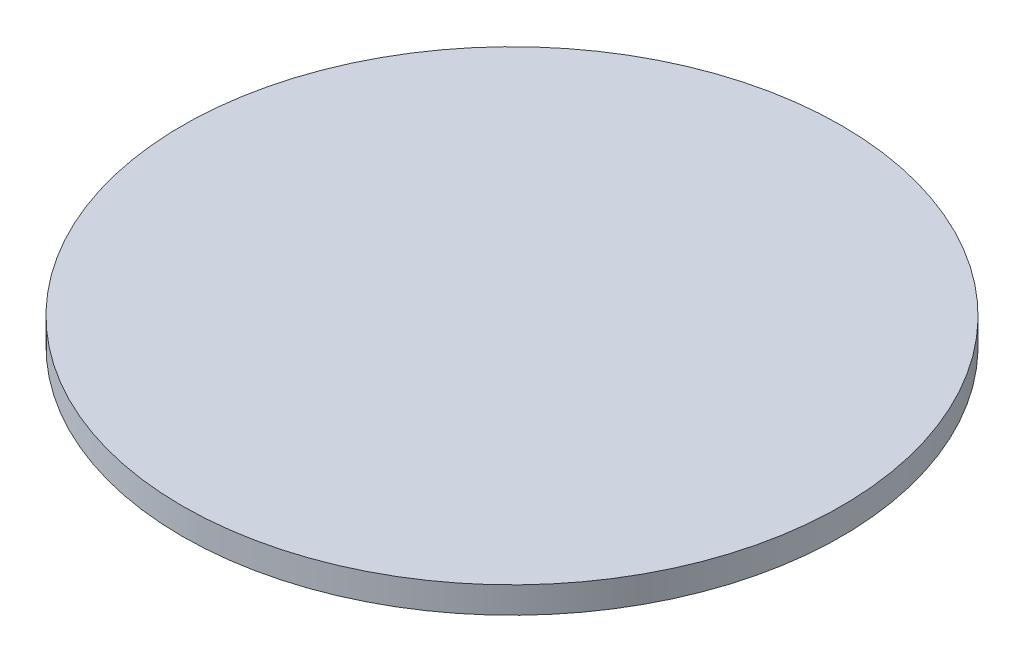
ISO-10303-21;
HEADER;
FILE_DESCRIPTION(('STEP AP214'),'2;1');
FILE_NAME('part.step','',(''),(''),'','','');
FILE_SCHEMA(('AUTOMOTIVE_DESIGN { 1 0 10303 214 1 1 1 1 }'));
ENDSEC;
DATA;
#1=APPLICATION_CONTEXT('core data for automotive mechanical design processes');
#2=APPLICATION_PROTOCOL_DEFINITION('international standard','automotive_design',2000,#1);
#3=PRODUCT_CONTEXT('',#1,'mechanical');
#4=PRODUCT('Part','Part','',(#3));
#5=PRODUCT_RELATED_PRODUCT_CATEGORY('part','',(#4));
#6=PRODUCT_DEFINITION_FORMATION('','',#4);
#7=PRODUCT_DEFINITION_CONTEXT('part definition',#1,'design');
#8=PRODUCT_DEFINITION('design','',#6,#7);
#9=PRODUCT_DEFINITION_SHAPE('','',#8);
#10=(LENGTH_UNIT() NAMED_UNIT(*) SI_UNIT(.MILLI.,.METRE.));
#11=(NAMED_UNIT(*) PLANE_ANGLE_UNIT() SI_UNIT($,.RADIAN.));
#12=(NAMED_UNIT(*) SI_UNIT($,.STERADIAN.) SOLID_ANGLE_UNIT());
#13=UNCERTAINTY_MEASURE_WITH_UNIT(LENGTH_MEASURE(1.E-05),#10,'distance_accuracy_value','');
#14=(GEOMETRIC_REPRESENTATION_CONTEXT(3) GLOBAL_UNCERTAINTY_ASSIGNED_CONTEXT((#13)) GLOBAL_UNIT_ASSIGNED_CONTEXT((#10,
#11,#12)) REPRESENTATION_CONTEXT('',''));
#15=CARTESIAN_POINT('',(0.,0.,0.));
#16=DIRECTION('',(0.,0.,1.));
#17=DIRECTION('',(1.,0.,0.));
#18=AXIS2_PLACEMENT_3D('',#15,#16,#17);
#19=CARTESIAN_POINT('',(-1.57120846007336,2.,0.));
#20=DIRECTION('',(0.,-1.,0.));
#21=DIRECTION('',(0.,0.,-1.));
#22=AXIS2_PLACEMENT_3D('',#19,#20,#21);
#23=CYLINDRICAL_SURFACE('',#22,25.);
#24=CARTESIAN_POINT('',(-1.57120846007336,2.,0.));
#25=DIRECTION('',(0.,1.,0.));
#26=DIRECTION('',(0.,0.,1.));
#27=AXIS2_PLACEMENT_3D('',#24,#25,#26);
#28=CIRCLE('',#27,25.);
#29=CARTESIAN_POINT('',(-1.57120846007336,2.,25.));
#30=VERTEX_POINT('',#29);
#31=EDGE_CURVE('E10',#30,#30,#28,.T.);
#32=ORIENTED_EDGE('',*,*,#31,.F.);
#33=EDGE_LOOP('',(#32));
#34=FACE_BOUND('',#33,.T.);
#35=CARTESIAN_POINT('',(-1.57120846007336,0.,0.));
#36=DIRECTION('',(0.,1.,0.));
#37=DIRECTION('',(0.,0.,1.));
#38=AXIS2_PLACEMENT_3D('',#35,#36,#37);
#39=CIRCLE('',#38,25.);
#40=CARTESIAN_POINT('',(-1.57120846007336,0.,25.));
#41=VERTEX_POINT('',#40);
#42=EDGE_CURVE('E34',#41,#41,#39,.T.);
#43=ORIENTED_EDGE('',*,*,#42,.T.);
#44=EDGE_LOOP('',(#43));
#45=FACE_BOUND('',#44,.T.);
#46=ADVANCED_FACE('F31',(#34,#45),#23,.T.);
#47=CARTESIAN_POINT('',(-1.57120846007336,2.,0.));
#48=DIRECTION('',(0.,1.,0.));
#49=DIRECTION('',(0.,0.,1.));
#50=AXIS2_PLACEMENT_3D('',#47,#48,#49);
#51=PLANE('',#50);
#52=ORIENTED_EDGE('',*,*,#31,.T.);
#53=EDGE_LOOP('',(#52));
#54=FACE_BOUND('',#53,.T.);
#55=ADVANCED_FACE('F46',(#54),#51,.T.);
#56=CARTESIAN_POINT('',(-1.57120846007336,0.,0.));
#57=DIRECTION('',(0.,1.,0.));
#58=DIRECTION('',(0.,0.,1.));
#59=AXIS2_PLACEMENT_3D('',#56,#57,#58);
#60=PLANE('',#59);
#61=ORIENTED_EDGE('',*,*,#42,.F.);
#62=EDGE_LOOP('',(#61));
#63=FACE_BOUND('',#62,.T.);
#64=ADVANCED_FACE('F44',(#63),#60,.F.);
#65=CLOSED_SHELL('',(#46,#55,#64));
#66=MANIFOLD_SOLID_BREP('B2',#65);
#67=ADVANCED_BREP_SHAPE_REPRESENTATION('',(#18,#66),#14);
#68=SHAPE_DEFINITION_REPRESENTATION(#9,#67);
ENDSEC;
END-ISO-10303-21;
